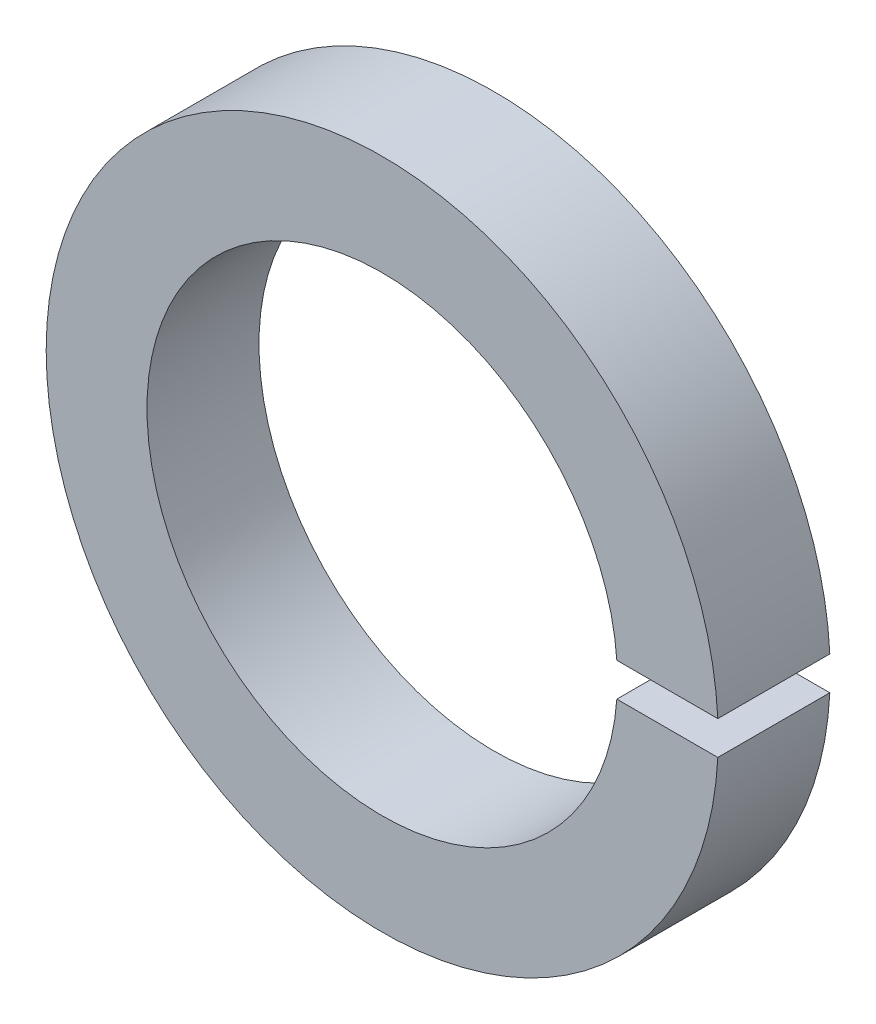
ISO-10303-21;
HEADER;
FILE_DESCRIPTION(('STEP AP214'),'2;1');
FILE_NAME('part.step','',(''),(''),'','','');
FILE_SCHEMA(('AUTOMOTIVE_DESIGN { 1 0 10303 214 1 1 1 1 }'));
ENDSEC;
DATA;
#1=APPLICATION_CONTEXT('core data for automotive mechanical design processes');
#2=APPLICATION_PROTOCOL_DEFINITION('international standard','automotive_design',2000,#1);
#3=PRODUCT_CONTEXT('',#1,'mechanical');
#4=PRODUCT('Part','Part','',(#3));
#5=PRODUCT_RELATED_PRODUCT_CATEGORY('part','',(#4));
#6=PRODUCT_DEFINITION_FORMATION('','',#4);
#7=PRODUCT_DEFINITION_CONTEXT('part definition',#1,'design');
#8=PRODUCT_DEFINITION('design','',#6,#7);
#9=PRODUCT_DEFINITION_SHAPE('','',#8);
#10=(LENGTH_UNIT() NAMED_UNIT(*) SI_UNIT(.MILLI.,.METRE.));
#11=(NAMED_UNIT(*) PLANE_ANGLE_UNIT() SI_UNIT($,.RADIAN.));
#12=(NAMED_UNIT(*) SI_UNIT($,.STERADIAN.) SOLID_ANGLE_UNIT());
#13=UNCERTAINTY_MEASURE_WITH_UNIT(LENGTH_MEASURE(1.E-05),#10,'distance_accuracy_value','');
#14=(GEOMETRIC_REPRESENTATION_CONTEXT(3) GLOBAL_UNCERTAINTY_ASSIGNED_CONTEXT((#13)) GLOBAL_UNIT_ASSIGNED_CONTEXT((#10,
#11,#12)) REPRESENTATION_CONTEXT('',''));
#15=CARTESIAN_POINT('',(0.,0.,0.));
#16=DIRECTION('',(0.,0.,1.));
#17=DIRECTION('',(1.,0.,0.));
#18=AXIS2_PLACEMENT_3D('',#15,#16,#17);
#19=CARTESIAN_POINT('',(0.,0.,5.));
#20=DIRECTION('',(0.,0.,1.));
#21=DIRECTION('',(1.,0.,0.));
#22=AXIS2_PLACEMENT_3D('',#19,#20,#21);
#23=PLANE('',#22);
#24=DIRECTION('',(1.,0.,0.));
#25=VECTOR('',#24,1.);
#26=CARTESIAN_POINT('',(15.5633983697285,0.75,5.));
#27=LINE('',#26,#25);
#28=CARTESIAN_POINT('',(10.4731800328267,0.75,5.));
#29=VERTEX_POINT('',#28);
#30=CARTESIAN_POINT('',(14.9812382665786,0.75,5.));
#31=VERTEX_POINT('',#30);
#32=EDGE_CURVE('E55',#29,#31,#27,.T.);
#33=ORIENTED_EDGE('',*,*,#32,.T.);
#34=CARTESIAN_POINT('',(0.,0.,5.));
#35=DIRECTION('',(0.,0.,1.));
#36=DIRECTION('',(1.,0.,0.));
#37=AXIS2_PLACEMENT_3D('',#34,#35,#36);
#38=CIRCLE('',#37,15.);
#39=CARTESIAN_POINT('',(14.9812382665786,-0.75,5.));
#40=VERTEX_POINT('',#39);
#41=EDGE_CURVE('E92',#31,#40,#38,.T.);
#42=ORIENTED_EDGE('',*,*,#41,.T.);
#43=DIRECTION('',(-1.,0.,0.));
#44=VECTOR('',#43,1.);
#45=CARTESIAN_POINT('',(15.5633983697285,-0.75,5.));
#46=LINE('',#45,#44);
#47=CARTESIAN_POINT('',(10.4731800328267,-0.75,5.));
#48=VERTEX_POINT('',#47);
#49=EDGE_CURVE('E74',#40,#48,#46,.T.);
#50=ORIENTED_EDGE('',*,*,#49,.T.);
#51=CARTESIAN_POINT('',(0.,0.,5.));
#52=DIRECTION('',(0.,0.,1.));
#53=DIRECTION('',(1.,0.,0.));
#54=AXIS2_PLACEMENT_3D('',#51,#52,#53);
#55=CIRCLE('',#54,10.5);
#56=EDGE_CURVE('E93',#29,#48,#55,.T.);
#57=ORIENTED_EDGE('',*,*,#56,.F.);
#58=EDGE_LOOP('',(#33,#42,#50,#57));
#59=FACE_BOUND('',#58,.T.);
#60=ADVANCED_FACE('F33',(#59),#23,.T.);
#61=CARTESIAN_POINT('',(0.,0.,0.));
#62=DIRECTION('',(0.,0.,1.));
#63=DIRECTION('',(1.,0.,0.));
#64=AXIS2_PLACEMENT_3D('',#61,#62,#63);
#65=PLANE('',#64);
#66=CARTESIAN_POINT('',(0.,0.,0.));
#67=DIRECTION('',(0.,0.,1.));
#68=DIRECTION('',(1.,0.,0.));
#69=AXIS2_PLACEMENT_3D('',#66,#67,#68);
#70=CIRCLE('',#69,15.);
#71=CARTESIAN_POINT('',(14.9812382665786,0.75,0.));
#72=VERTEX_POINT('',#71);
#73=CARTESIAN_POINT('',(14.9812382665786,-0.75,0.));
#74=VERTEX_POINT('',#73);
#75=EDGE_CURVE('E86',#72,#74,#70,.T.);
#76=ORIENTED_EDGE('',*,*,#75,.F.);
#77=DIRECTION('',(1.,0.,0.));
#78=VECTOR('',#77,1.);
#79=CARTESIAN_POINT('',(15.5633983697285,0.75,0.));
#80=LINE('',#79,#78);
#81=CARTESIAN_POINT('',(10.4731800328267,0.75,0.));
#82=VERTEX_POINT('',#81);
#83=EDGE_CURVE('E89',#82,#72,#80,.T.);
#84=ORIENTED_EDGE('',*,*,#83,.F.);
#85=CARTESIAN_POINT('',(0.,0.,0.));
#86=DIRECTION('',(0.,0.,1.));
#87=DIRECTION('',(1.,0.,0.));
#88=AXIS2_PLACEMENT_3D('',#85,#86,#87);
#89=CIRCLE('',#88,10.5);
#90=CARTESIAN_POINT('',(10.4731800328267,-0.75,0.));
#91=VERTEX_POINT('',#90);
#92=EDGE_CURVE('E88',#82,#91,#89,.T.);
#93=ORIENTED_EDGE('',*,*,#92,.T.);
#94=DIRECTION('',(-1.,0.,0.));
#95=VECTOR('',#94,1.);
#96=CARTESIAN_POINT('',(15.5633983697285,-0.75,0.));
#97=LINE('',#96,#95);
#98=EDGE_CURVE('E48',#74,#91,#97,.T.);
#99=ORIENTED_EDGE('',*,*,#98,.F.);
#100=EDGE_LOOP('',(#76,#84,#93,#99));
#101=FACE_BOUND('',#100,.T.);
#102=ADVANCED_FACE('F84',(#101),#65,.F.);
#103=CARTESIAN_POINT('',(0.,0.,5.));
#104=DIRECTION('',(0.,0.,-1.));
#105=DIRECTION('',(-1.,0.,0.));
#106=AXIS2_PLACEMENT_3D('',#103,#104,#105);
#107=CYLINDRICAL_SURFACE('',#106,15.);
#108=ORIENTED_EDGE('',*,*,#41,.F.);
#109=DIRECTION('',(0.,0.,-1.));
#110=VECTOR('',#109,1.);
#111=CARTESIAN_POINT('',(14.9812382665786,0.75,5.));
#112=LINE('',#111,#110);
#113=EDGE_CURVE('E79',#31,#72,#112,.T.);
#114=ORIENTED_EDGE('',*,*,#113,.T.);
#115=ORIENTED_EDGE('',*,*,#75,.T.);
#116=DIRECTION('',(0.,0.,-1.));
#117=VECTOR('',#116,1.);
#118=CARTESIAN_POINT('',(14.9812382665786,-0.75,5.));
#119=LINE('',#118,#117);
#120=EDGE_CURVE('E71',#74,#40,#119,.F.);
#121=ORIENTED_EDGE('',*,*,#120,.T.);
#122=EDGE_LOOP('',(#108,#114,#115,#121));
#123=FACE_BOUND('',#122,.T.);
#124=ADVANCED_FACE('F35',(#123),#107,.T.);
#125=CARTESIAN_POINT('',(0.,0.,5.));
#126=DIRECTION('',(0.,0.,-1.));
#127=DIRECTION('',(-1.,0.,0.));
#128=AXIS2_PLACEMENT_3D('',#125,#126,#127);
#129=CYLINDRICAL_SURFACE('',#128,10.5);
#130=DIRECTION('',(0.,0.,-1.));
#131=VECTOR('',#130,1.);
#132=CARTESIAN_POINT('',(10.4731800328267,0.75,5.));
#133=LINE('',#132,#131);
#134=EDGE_CURVE('E11',#29,#82,#133,.T.);
#135=ORIENTED_EDGE('',*,*,#134,.F.);
#136=ORIENTED_EDGE('',*,*,#56,.T.);
#137=DIRECTION('',(0.,0.,-1.));
#138=VECTOR('',#137,1.);
#139=CARTESIAN_POINT('',(10.4731800328267,-0.75,5.));
#140=LINE('',#139,#138);
#141=EDGE_CURVE('E41',#91,#48,#140,.F.);
#142=ORIENTED_EDGE('',*,*,#141,.F.);
#143=ORIENTED_EDGE('',*,*,#92,.F.);
#144=EDGE_LOOP('',(#135,#136,#142,#143));
#145=FACE_BOUND('',#144,.T.);
#146=ADVANCED_FACE('F103',(#145),#129,.F.);
#147=CARTESIAN_POINT('',(15.5633983697285,-0.75,5.));
#148=DIRECTION('',(0.,-1.,0.));
#149=DIRECTION('',(0.,0.,-1.));
#150=AXIS2_PLACEMENT_3D('',#147,#148,#149);
#151=PLANE('',#150);
#152=ORIENTED_EDGE('',*,*,#98,.T.);
#153=ORIENTED_EDGE('',*,*,#141,.T.);
#154=ORIENTED_EDGE('',*,*,#49,.F.);
#155=ORIENTED_EDGE('',*,*,#120,.F.);
#156=EDGE_LOOP('',(#152,#153,#154,#155));
#157=FACE_BOUND('',#156,.T.);
#158=ADVANCED_FACE('F72',(#157),#151,.F.);
#159=CARTESIAN_POINT('',(15.5633983697285,0.75,5.));
#160=DIRECTION('',(0.,1.,0.));
#161=DIRECTION('',(0.,0.,1.));
#162=AXIS2_PLACEMENT_3D('',#159,#160,#161);
#163=PLANE('',#162);
#164=ORIENTED_EDGE('',*,*,#32,.F.);
#165=ORIENTED_EDGE('',*,*,#134,.T.);
#166=ORIENTED_EDGE('',*,*,#83,.T.);
#167=ORIENTED_EDGE('',*,*,#113,.F.);
#168=EDGE_LOOP('',(#164,#165,#166,#167));
#169=FACE_BOUND('',#168,.T.);
#170=ADVANCED_FACE('F104',(#169),#163,.F.);
#171=CLOSED_SHELL('',(#60,#102,#124,#146,#158,#170));
#172=MANIFOLD_SOLID_BREP('B2',#171);
#173=ADVANCED_BREP_SHAPE_REPRESENTATION('',(#18,#172),#14);
#174=SHAPE_DEFINITION_REPRESENTATION(#9,#173);
ENDSEC;
END-ISO-10303-21;
